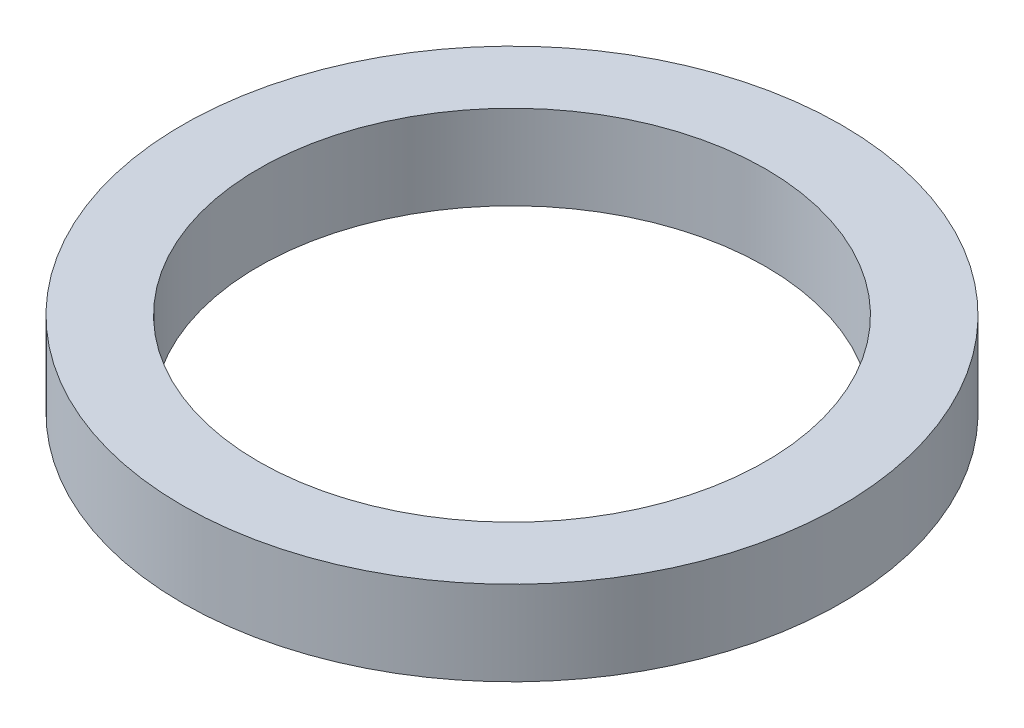
ISO-10303-21;
HEADER;
FILE_DESCRIPTION(('STEP AP214'),'2;1');
FILE_NAME('part.step','',(''),(''),'','','');
FILE_SCHEMA(('AUTOMOTIVE_DESIGN { 1 0 10303 214 1 1 1 1 }'));
ENDSEC;
DATA;
#1=APPLICATION_CONTEXT('core data for automotive mechanical design processes');
#2=APPLICATION_PROTOCOL_DEFINITION('international standard','automotive_design',2000,#1);
#3=PRODUCT_CONTEXT('',#1,'mechanical');
#4=PRODUCT('Part','Part','',(#3));
#5=PRODUCT_RELATED_PRODUCT_CATEGORY('part','',(#4));
#6=PRODUCT_DEFINITION_FORMATION('','',#4);
#7=PRODUCT_DEFINITION_CONTEXT('part definition',#1,'design');
#8=PRODUCT_DEFINITION('design','',#6,#7);
#9=PRODUCT_DEFINITION_SHAPE('','',#8);
#10=(LENGTH_UNIT() NAMED_UNIT(*) SI_UNIT(.MILLI.,.METRE.));
#11=(NAMED_UNIT(*) PLANE_ANGLE_UNIT() SI_UNIT($,.RADIAN.));
#12=(NAMED_UNIT(*) SI_UNIT($,.STERADIAN.) SOLID_ANGLE_UNIT());
#13=UNCERTAINTY_MEASURE_WITH_UNIT(LENGTH_MEASURE(1.E-05),#10,'distance_accuracy_value','');
#14=(GEOMETRIC_REPRESENTATION_CONTEXT(3) GLOBAL_UNCERTAINTY_ASSIGNED_CONTEXT((#13)) GLOBAL_UNIT_ASSIGNED_CONTEXT((#10,
#11,#12)) REPRESENTATION_CONTEXT('',''));
#15=CARTESIAN_POINT('',(0.,0.,0.));
#16=DIRECTION('',(0.,0.,1.));
#17=DIRECTION('',(1.,0.,0.));
#18=AXIS2_PLACEMENT_3D('',#15,#16,#17);
#19=CARTESIAN_POINT('',(0.,10.,0.));
#20=DIRECTION('',(0.,1.,0.));
#21=DIRECTION('',(0.,0.,1.));
#22=AXIS2_PLACEMENT_3D('',#19,#20,#21);
#23=PLANE('',#22);
#24=CARTESIAN_POINT('',(0.,10.,0.));
#25=DIRECTION('',(0.,1.,0.));
#26=DIRECTION('',(0.,0.,1.));
#27=AXIS2_PLACEMENT_3D('',#24,#25,#26);
#28=CIRCLE('',#27,39.);
#29=CARTESIAN_POINT('',(0.,10.,39.));
#30=VERTEX_POINT('',#29);
#31=EDGE_CURVE('E10',#30,#30,#28,.T.);
#32=ORIENTED_EDGE('',*,*,#31,.T.);
#33=EDGE_LOOP('',(#32));
#34=FACE_BOUND('',#33,.T.);
#35=CARTESIAN_POINT('',(0.,10.,0.));
#36=DIRECTION('',(0.,1.,0.));
#37=DIRECTION('',(0.,0.,1.));
#38=AXIS2_PLACEMENT_3D('',#35,#36,#37);
#39=CIRCLE('',#38,30.);
#40=CARTESIAN_POINT('',(0.,10.,30.));
#41=VERTEX_POINT('',#40);
#42=EDGE_CURVE('E46',#41,#41,#39,.T.);
#43=ORIENTED_EDGE('',*,*,#42,.F.);
#44=EDGE_LOOP('',(#43));
#45=FACE_BOUND('',#44,.T.);
#46=ADVANCED_FACE('F35',(#34,#45),#23,.T.);
#47=CARTESIAN_POINT('',(0.,0.,0.));
#48=DIRECTION('',(0.,1.,0.));
#49=DIRECTION('',(0.,0.,1.));
#50=AXIS2_PLACEMENT_3D('',#47,#48,#49);
#51=PLANE('',#50);
#52=CARTESIAN_POINT('',(0.,0.,0.));
#53=DIRECTION('',(0.,1.,0.));
#54=DIRECTION('',(0.,0.,1.));
#55=AXIS2_PLACEMENT_3D('',#52,#53,#54);
#56=CIRCLE('',#55,39.);
#57=CARTESIAN_POINT('',(0.,0.,39.));
#58=VERTEX_POINT('',#57);
#59=EDGE_CURVE('E39',#58,#58,#56,.T.);
#60=ORIENTED_EDGE('',*,*,#59,.F.);
#61=EDGE_LOOP('',(#60));
#62=FACE_BOUND('',#61,.T.);
#63=CARTESIAN_POINT('',(0.,0.,0.));
#64=DIRECTION('',(0.,1.,0.));
#65=DIRECTION('',(0.,0.,1.));
#66=AXIS2_PLACEMENT_3D('',#63,#64,#65);
#67=CIRCLE('',#66,30.);
#68=CARTESIAN_POINT('',(0.,0.,30.));
#69=VERTEX_POINT('',#68);
#70=EDGE_CURVE('E48',#69,#69,#67,.T.);
#71=ORIENTED_EDGE('',*,*,#70,.T.);
#72=EDGE_LOOP('',(#71));
#73=FACE_BOUND('',#72,.T.);
#74=ADVANCED_FACE('F58',(#62,#73),#51,.F.);
#75=CARTESIAN_POINT('',(0.,10.,0.));
#76=DIRECTION('',(0.,-1.,0.));
#77=DIRECTION('',(0.,0.,-1.));
#78=AXIS2_PLACEMENT_3D('',#75,#76,#77);
#79=CYLINDRICAL_SURFACE('',#78,39.);
#80=ORIENTED_EDGE('',*,*,#31,.F.);
#81=EDGE_LOOP('',(#80));
#82=FACE_BOUND('',#81,.T.);
#83=ORIENTED_EDGE('',*,*,#59,.T.);
#84=EDGE_LOOP('',(#83));
#85=FACE_BOUND('',#84,.T.);
#86=ADVANCED_FACE('F37',(#82,#85),#79,.T.);
#87=CARTESIAN_POINT('',(0.,10.,0.));
#88=DIRECTION('',(0.,-1.,0.));
#89=DIRECTION('',(0.,0.,-1.));
#90=AXIS2_PLACEMENT_3D('',#87,#88,#89);
#91=CYLINDRICAL_SURFACE('',#90,30.);
#92=ORIENTED_EDGE('',*,*,#42,.T.);
#93=EDGE_LOOP('',(#92));
#94=FACE_BOUND('',#93,.T.);
#95=ORIENTED_EDGE('',*,*,#70,.F.);
#96=EDGE_LOOP('',(#95));
#97=FACE_BOUND('',#96,.T.);
#98=ADVANCED_FACE('F54',(#94,#97),#91,.F.);
#99=CLOSED_SHELL('',(#46,#74,#86,#98));
#100=MANIFOLD_SOLID_BREP('B2',#99);
#101=ADVANCED_BREP_SHAPE_REPRESENTATION('',(#18,#100),#14);
#102=SHAPE_DEFINITION_REPRESENTATION(#9,#101);
ENDSEC;
END-ISO-10303-21;
